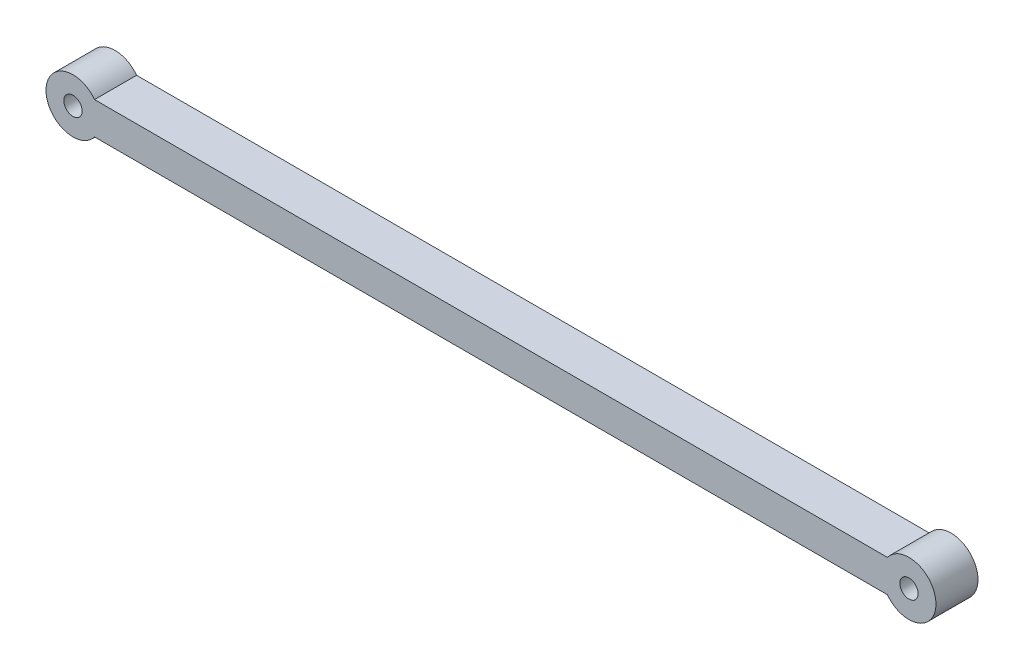
ISO-10303-21;
HEADER;
FILE_DESCRIPTION(('STEP AP214'),'2;1');
FILE_NAME('part.step','',(''),(''),'','','');
FILE_SCHEMA(('AUTOMOTIVE_DESIGN { 1 0 10303 214 1 1 1 1 }'));
ENDSEC;
DATA;
#1=APPLICATION_CONTEXT('core data for automotive mechanical design processes');
#2=APPLICATION_PROTOCOL_DEFINITION('international standard','automotive_design',2000,#1);
#3=PRODUCT_CONTEXT('',#1,'mechanical');
#4=PRODUCT('Part','Part','',(#3));
#5=PRODUCT_RELATED_PRODUCT_CATEGORY('part','',(#4));
#6=PRODUCT_DEFINITION_FORMATION('','',#4);
#7=PRODUCT_DEFINITION_CONTEXT('part definition',#1,'design');
#8=PRODUCT_DEFINITION('design','',#6,#7);
#9=PRODUCT_DEFINITION_SHAPE('','',#8);
#10=(LENGTH_UNIT() NAMED_UNIT(*) SI_UNIT(.MILLI.,.METRE.));
#11=(NAMED_UNIT(*) PLANE_ANGLE_UNIT() SI_UNIT($,.RADIAN.));
#12=(NAMED_UNIT(*) SI_UNIT($,.STERADIAN.) SOLID_ANGLE_UNIT());
#13=UNCERTAINTY_MEASURE_WITH_UNIT(LENGTH_MEASURE(1.E-05),#10,'distance_accuracy_value','');
#14=(GEOMETRIC_REPRESENTATION_CONTEXT(3) GLOBAL_UNCERTAINTY_ASSIGNED_CONTEXT((#13)) GLOBAL_UNIT_ASSIGNED_CONTEXT((#10,
#11,#12)) REPRESENTATION_CONTEXT('',''));
#15=CARTESIAN_POINT('',(0.,0.,0.));
#16=DIRECTION('',(0.,0.,1.));
#17=DIRECTION('',(1.,0.,0.));
#18=AXIS2_PLACEMENT_3D('',#15,#16,#17);
#19=CARTESIAN_POINT('',(0.,50.,7.8));
#20=DIRECTION('',(0.,0.,1.));
#21=DIRECTION('',(1.,0.,0.));
#22=AXIS2_PLACEMENT_3D('',#19,#20,#21);
#23=PLANE('',#22);
#24=CARTESIAN_POINT('',(0.,50.,7.8));
#25=DIRECTION('',(0.,0.,1.));
#26=DIRECTION('',(1.,0.,0.));
#27=AXIS2_PLACEMENT_3D('',#24,#25,#26);
#28=CIRCLE('',#27,1.69999999999999);
#29=CARTESIAN_POINT('',(1.69999999999997,50.,7.8));
#30=VERTEX_POINT('',#29);
#31=EDGE_CURVE('E101',#30,#30,#28,.T.);
#32=ORIENTED_EDGE('',*,*,#31,.F.);
#33=EDGE_LOOP('',(#32));
#34=FACE_BOUND('',#33,.T.);
#35=CARTESIAN_POINT('',(0.,50.,7.8));
#36=DIRECTION('',(0.,0.,1.));
#37=DIRECTION('',(1.,0.,0.));
#38=AXIS2_PLACEMENT_3D('',#35,#36,#37);
#39=CIRCLE('',#38,5.);
#40=CARTESIAN_POINT('',(3.99999999999998,53.,7.8));
#41=VERTEX_POINT('',#40);
#42=CARTESIAN_POINT('',(3.99999999999998,47.,7.8));
#43=VERTEX_POINT('',#42);
#44=EDGE_CURVE('E86',#41,#43,#39,.T.);
#45=ORIENTED_EDGE('',*,*,#44,.T.);
#46=DIRECTION('',(1.,0.,0.));
#47=VECTOR('',#46,1.);
#48=CARTESIAN_POINT('',(3.99999999999998,47.,7.8));
#49=LINE('',#48,#47);
#50=CARTESIAN_POINT('',(151.,47.,7.8));
#51=VERTEX_POINT('',#50);
#52=EDGE_CURVE('E81',#43,#51,#49,.T.);
#53=ORIENTED_EDGE('',*,*,#52,.T.);
#54=CARTESIAN_POINT('',(155.,50.,7.8));
#55=DIRECTION('',(0.,0.,1.));
#56=DIRECTION('',(1.,0.,0.));
#57=AXIS2_PLACEMENT_3D('',#54,#55,#56);
#58=CIRCLE('',#57,4.99999999999998);
#59=CARTESIAN_POINT('',(151.,53.,7.8));
#60=VERTEX_POINT('',#59);
#61=EDGE_CURVE('E84',#51,#60,#58,.T.);
#62=ORIENTED_EDGE('',*,*,#61,.T.);
#63=DIRECTION('',(-1.,0.,0.));
#64=VECTOR('',#63,1.);
#65=CARTESIAN_POINT('',(3.99999999999998,53.,7.8));
#66=LINE('',#65,#64);
#67=EDGE_CURVE('E51',#60,#41,#66,.T.);
#68=ORIENTED_EDGE('',*,*,#67,.T.);
#69=EDGE_LOOP('',(#45,#53,#62,#68));
#70=FACE_BOUND('',#69,.T.);
#71=CARTESIAN_POINT('',(155.,50.,7.8));
#72=DIRECTION('',(0.,0.,1.));
#73=DIRECTION('',(1.,0.,0.));
#74=AXIS2_PLACEMENT_3D('',#71,#72,#73);
#75=CIRCLE('',#74,1.70000000000001);
#76=CARTESIAN_POINT('',(156.7,50.,7.8));
#77=VERTEX_POINT('',#76);
#78=EDGE_CURVE('E116',#77,#77,#75,.T.);
#79=ORIENTED_EDGE('',*,*,#78,.F.);
#80=EDGE_LOOP('',(#79));
#81=FACE_BOUND('',#80,.T.);
#82=ADVANCED_FACE('F34',(#34,#70,#81),#23,.T.);
#83=CARTESIAN_POINT('',(0.,50.,0.));
#84=DIRECTION('',(0.,0.,1.));
#85=DIRECTION('',(1.,0.,0.));
#86=AXIS2_PLACEMENT_3D('',#83,#84,#85);
#87=PLANE('',#86);
#88=CARTESIAN_POINT('',(0.,50.,0.));
#89=DIRECTION('',(0.,0.,1.));
#90=DIRECTION('',(1.,0.,0.));
#91=AXIS2_PLACEMENT_3D('',#88,#89,#90);
#92=CIRCLE('',#91,1.69999999999999);
#93=CARTESIAN_POINT('',(1.69999999999997,50.,0.));
#94=VERTEX_POINT('',#93);
#95=EDGE_CURVE('E113',#94,#94,#92,.T.);
#96=ORIENTED_EDGE('',*,*,#95,.T.);
#97=EDGE_LOOP('',(#96));
#98=FACE_BOUND('',#97,.T.);
#99=CARTESIAN_POINT('',(0.,50.,0.));
#100=DIRECTION('',(0.,0.,1.));
#101=DIRECTION('',(1.,0.,0.));
#102=AXIS2_PLACEMENT_3D('',#99,#100,#101);
#103=CIRCLE('',#102,5.);
#104=CARTESIAN_POINT('',(3.99999999999998,53.,0.));
#105=VERTEX_POINT('',#104);
#106=CARTESIAN_POINT('',(3.99999999999998,47.,0.));
#107=VERTEX_POINT('',#106);
#108=EDGE_CURVE('E98',#105,#107,#103,.T.);
#109=ORIENTED_EDGE('',*,*,#108,.F.);
#110=DIRECTION('',(-1.,0.,0.));
#111=VECTOR('',#110,1.);
#112=CARTESIAN_POINT('',(3.99999999999998,53.,0.));
#113=LINE('',#112,#111);
#114=CARTESIAN_POINT('',(151.,53.,0.));
#115=VERTEX_POINT('',#114);
#116=EDGE_CURVE('E74',#115,#105,#113,.T.);
#117=ORIENTED_EDGE('',*,*,#116,.F.);
#118=CARTESIAN_POINT('',(155.,50.,0.));
#119=DIRECTION('',(0.,0.,1.));
#120=DIRECTION('',(1.,0.,0.));
#121=AXIS2_PLACEMENT_3D('',#118,#119,#120);
#122=CIRCLE('',#121,4.99999999999998);
#123=CARTESIAN_POINT('',(151.,47.,0.));
#124=VERTEX_POINT('',#123);
#125=EDGE_CURVE('E68',#124,#115,#122,.T.);
#126=ORIENTED_EDGE('',*,*,#125,.F.);
#127=DIRECTION('',(1.,0.,0.));
#128=VECTOR('',#127,1.);
#129=CARTESIAN_POINT('',(3.99999999999998,47.,0.));
#130=LINE('',#129,#128);
#131=EDGE_CURVE('E90',#107,#124,#130,.T.);
#132=ORIENTED_EDGE('',*,*,#131,.F.);
#133=EDGE_LOOP('',(#109,#117,#126,#132));
#134=FACE_BOUND('',#133,.T.);
#135=CARTESIAN_POINT('',(155.,50.,0.));
#136=DIRECTION('',(0.,0.,1.));
#137=DIRECTION('',(1.,0.,0.));
#138=AXIS2_PLACEMENT_3D('',#135,#136,#137);
#139=CIRCLE('',#138,1.70000000000001);
#140=CARTESIAN_POINT('',(156.7,50.,0.));
#141=VERTEX_POINT('',#140);
#142=EDGE_CURVE('E119',#141,#141,#139,.T.);
#143=ORIENTED_EDGE('',*,*,#142,.T.);
#144=EDGE_LOOP('',(#143));
#145=FACE_BOUND('',#144,.T.);
#146=ADVANCED_FACE('F109',(#98,#134,#145),#87,.F.);
#147=CARTESIAN_POINT('',(0.,50.,7.8));
#148=DIRECTION('',(0.,0.,-1.));
#149=DIRECTION('',(-1.,0.,0.));
#150=AXIS2_PLACEMENT_3D('',#147,#148,#149);
#151=CYLINDRICAL_SURFACE('',#150,5.);
#152=ORIENTED_EDGE('',*,*,#108,.T.);
#153=DIRECTION('',(0.,0.,-1.));
#154=VECTOR('',#153,1.);
#155=CARTESIAN_POINT('',(3.99999999999998,47.,7.8));
#156=LINE('',#155,#154);
#157=EDGE_CURVE('E11',#43,#107,#156,.T.);
#158=ORIENTED_EDGE('',*,*,#157,.F.);
#159=ORIENTED_EDGE('',*,*,#44,.F.);
#160=DIRECTION('',(0.,0.,-1.));
#161=VECTOR('',#160,1.);
#162=CARTESIAN_POINT('',(3.99999999999998,53.,7.8));
#163=LINE('',#162,#161);
#164=EDGE_CURVE('E94',#41,#105,#163,.T.);
#165=ORIENTED_EDGE('',*,*,#164,.T.);
#166=EDGE_LOOP('',(#152,#158,#159,#165));
#167=FACE_BOUND('',#166,.T.);
#168=ADVANCED_FACE('F36',(#167),#151,.T.);
#169=CARTESIAN_POINT('',(3.99999999999998,47.,7.8));
#170=DIRECTION('',(0.,1.,0.));
#171=DIRECTION('',(0.,0.,1.));
#172=AXIS2_PLACEMENT_3D('',#169,#170,#171);
#173=PLANE('',#172);
#174=ORIENTED_EDGE('',*,*,#131,.T.);
#175=DIRECTION('',(0.,0.,-1.));
#176=VECTOR('',#175,1.);
#177=CARTESIAN_POINT('',(151.,47.,7.8));
#178=LINE('',#177,#176);
#179=EDGE_CURVE('E43',#51,#124,#178,.T.);
#180=ORIENTED_EDGE('',*,*,#179,.F.);
#181=ORIENTED_EDGE('',*,*,#52,.F.);
#182=ORIENTED_EDGE('',*,*,#157,.T.);
#183=EDGE_LOOP('',(#174,#180,#181,#182));
#184=FACE_BOUND('',#183,.T.);
#185=ADVANCED_FACE('F89',(#184),#173,.F.);
#186=CARTESIAN_POINT('',(155.,50.,7.8));
#187=DIRECTION('',(0.,0.,-1.));
#188=DIRECTION('',(-1.,0.,0.));
#189=AXIS2_PLACEMENT_3D('',#186,#187,#188);
#190=CYLINDRICAL_SURFACE('',#189,4.99999999999998);
#191=ORIENTED_EDGE('',*,*,#125,.T.);
#192=DIRECTION('',(0.,0.,-1.));
#193=VECTOR('',#192,1.);
#194=CARTESIAN_POINT('',(151.,53.,7.8));
#195=LINE('',#194,#193);
#196=EDGE_CURVE('E91',#60,#115,#195,.T.);
#197=ORIENTED_EDGE('',*,*,#196,.F.);
#198=ORIENTED_EDGE('',*,*,#61,.F.);
#199=ORIENTED_EDGE('',*,*,#179,.T.);
#200=EDGE_LOOP('',(#191,#197,#198,#199));
#201=FACE_BOUND('',#200,.T.);
#202=ADVANCED_FACE('F92',(#201),#190,.T.);
#203=CARTESIAN_POINT('',(3.99999999999998,53.,7.8));
#204=DIRECTION('',(0.,-1.,0.));
#205=DIRECTION('',(0.,0.,-1.));
#206=AXIS2_PLACEMENT_3D('',#203,#204,#205);
#207=PLANE('',#206);
#208=ORIENTED_EDGE('',*,*,#116,.T.);
#209=ORIENTED_EDGE('',*,*,#164,.F.);
#210=ORIENTED_EDGE('',*,*,#67,.F.);
#211=ORIENTED_EDGE('',*,*,#196,.T.);
#212=EDGE_LOOP('',(#208,#209,#210,#211));
#213=FACE_BOUND('',#212,.T.);
#214=ADVANCED_FACE('F106',(#213),#207,.F.);
#215=CARTESIAN_POINT('',(0.,50.,7.8));
#216=DIRECTION('',(0.,0.,-1.));
#217=DIRECTION('',(-1.,0.,0.));
#218=AXIS2_PLACEMENT_3D('',#215,#216,#217);
#219=CYLINDRICAL_SURFACE('',#218,1.69999999999999);
#220=ORIENTED_EDGE('',*,*,#31,.T.);
#221=EDGE_LOOP('',(#220));
#222=FACE_BOUND('',#221,.T.);
#223=ORIENTED_EDGE('',*,*,#95,.F.);
#224=EDGE_LOOP('',(#223));
#225=FACE_BOUND('',#224,.T.);
#226=ADVANCED_FACE('F137',(#222,#225),#219,.F.);
#227=CARTESIAN_POINT('',(155.,50.,7.8));
#228=DIRECTION('',(0.,0.,-1.));
#229=DIRECTION('',(-1.,0.,0.));
#230=AXIS2_PLACEMENT_3D('',#227,#228,#229);
#231=CYLINDRICAL_SURFACE('',#230,1.70000000000001);
#232=ORIENTED_EDGE('',*,*,#78,.T.);
#233=EDGE_LOOP('',(#232));
#234=FACE_BOUND('',#233,.T.);
#235=ORIENTED_EDGE('',*,*,#142,.F.);
#236=EDGE_LOOP('',(#235));
#237=FACE_BOUND('',#236,.T.);
#238=ADVANCED_FACE('F125',(#234,#237),#231,.F.);
#239=CLOSED_SHELL('',(#82,#146,#168,#185,#202,#214,#226,#238));
#240=MANIFOLD_SOLID_BREP('B2',#239);
#241=ADVANCED_BREP_SHAPE_REPRESENTATION('',(#18,#240),#14);
#242=SHAPE_DEFINITION_REPRESENTATION(#9,#241);
ENDSEC;
END-ISO-10303-21;
